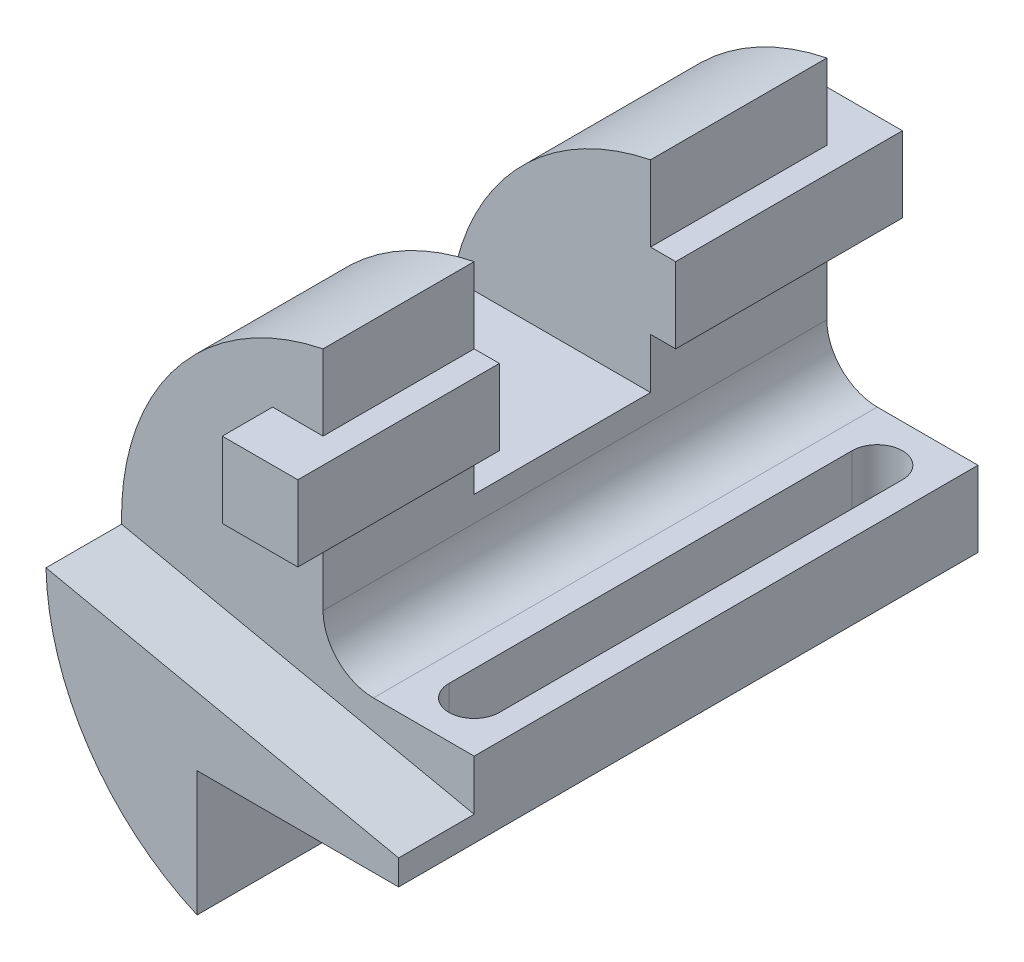
ISO-10303-21;
HEADER;
FILE_DESCRIPTION(('STEP AP214'),'2;1');
FILE_NAME('part.step','',(''),(''),'','','');
FILE_SCHEMA(('AUTOMOTIVE_DESIGN { 1 0 10303 214 1 1 1 1 }'));
ENDSEC;
DATA;
#1=APPLICATION_CONTEXT('core data for automotive mechanical design processes');
#2=APPLICATION_PROTOCOL_DEFINITION('international standard','automotive_design',2000,#1);
#3=PRODUCT_CONTEXT('',#1,'mechanical');
#4=PRODUCT('Part','Part','',(#3));
#5=PRODUCT_RELATED_PRODUCT_CATEGORY('part','',(#4));
#6=PRODUCT_DEFINITION_FORMATION('','',#4);
#7=PRODUCT_DEFINITION_CONTEXT('part definition',#1,'design');
#8=PRODUCT_DEFINITION('design','',#6,#7);
#9=PRODUCT_DEFINITION_SHAPE('','',#8);
#10=(LENGTH_UNIT() NAMED_UNIT(*) SI_UNIT(.MILLI.,.METRE.));
#11=(NAMED_UNIT(*) PLANE_ANGLE_UNIT() SI_UNIT($,.RADIAN.));
#12=(NAMED_UNIT(*) SI_UNIT($,.STERADIAN.) SOLID_ANGLE_UNIT());
#13=UNCERTAINTY_MEASURE_WITH_UNIT(LENGTH_MEASURE(1.E-05),#10,'distance_accuracy_value','');
#14=(GEOMETRIC_REPRESENTATION_CONTEXT(3) GLOBAL_UNCERTAINTY_ASSIGNED_CONTEXT((#13)) GLOBAL_UNIT_ASSIGNED_CONTEXT((#10,
#11,#12)) REPRESENTATION_CONTEXT('',''));
#15=CARTESIAN_POINT('',(0.,0.,0.));
#16=DIRECTION('',(0.,0.,1.));
#17=DIRECTION('',(1.,0.,0.));
#18=AXIS2_PLACEMENT_3D('',#15,#16,#17);
#19=CARTESIAN_POINT('',(-9.99999999999996,0.,-115.));
#20=DIRECTION('',(-1.,0.,0.));
#21=DIRECTION('',(0.,0.,1.));
#22=AXIS2_PLACEMENT_3D('',#19,#20,#21);
#23=PLANE('',#22);
#24=DIRECTION('',(0.,0.,1.));
#25=VECTOR('',#24,1.);
#26=CARTESIAN_POINT('',(-9.99999999999996,79.815551805222,-115.));
#27=LINE('',#26,#25);
#28=CARTESIAN_POINT('',(-9.99999999999996,79.815551805222,-45.));
#29=VERTEX_POINT('',#28);
#30=CARTESIAN_POINT('',(-9.99999999999996,79.815551805222,-15.));
#31=VERTEX_POINT('',#30);
#32=EDGE_CURVE('E345',#29,#31,#27,.T.);
#33=ORIENTED_EDGE('',*,*,#32,.F.);
#34=DIRECTION('',(0.,1.,0.));
#35=VECTOR('',#34,1.);
#36=CARTESIAN_POINT('',(-9.99999999999996,0.,-45.));
#37=LINE('',#36,#35);
#38=CARTESIAN_POINT('',(-10.0000000000001,94.815551805222,-45.));
#39=VERTEX_POINT('',#38);
#40=EDGE_CURVE('E292',#29,#39,#37,.T.);
#41=ORIENTED_EDGE('',*,*,#40,.T.);
#42=DIRECTION('',(0.,0.,1.));
#43=VECTOR('',#42,1.);
#44=CARTESIAN_POINT('',(-9.99999999999996,94.815551805222,-115.));
#45=LINE('',#44,#43);
#46=CARTESIAN_POINT('',(-9.99999999999996,94.815551805222,-15.));
#47=VERTEX_POINT('',#46);
#48=EDGE_CURVE('E394',#39,#47,#45,.T.);
#49=ORIENTED_EDGE('',*,*,#48,.T.);
#50=DIRECTION('',(0.,-1.,0.));
#51=VECTOR('',#50,1.);
#52=CARTESIAN_POINT('',(-9.99999999999996,0.,-15.));
#53=LINE('',#52,#51);
#54=EDGE_CURVE('E352',#47,#31,#53,.T.);
#55=ORIENTED_EDGE('',*,*,#54,.T.);
#56=EDGE_LOOP('',(#33,#41,#49,#55));
#57=FACE_BOUND('',#56,.T.);
#58=ADVANCED_FACE('F41',(#57),#23,.F.);
#59=CARTESIAN_POINT('',(-4.99999999999997,79.815551805222,26.2132034355964));
#60=DIRECTION('',(0.,-1.,0.));
#61=DIRECTION('',(1.,0.,0.));
#62=AXIS2_PLACEMENT_3D('',#59,#60,#61);
#63=PLANE('',#62);
#64=DIRECTION('',(0.,0.,-1.));
#65=VECTOR('',#64,1.);
#66=CARTESIAN_POINT('',(-4.99999999999997,79.815551805222,26.2132034355964));
#67=LINE('',#66,#65);
#68=CARTESIAN_POINT('',(-4.99999999999997,79.815551805222,-5.));
#69=VERTEX_POINT('',#68);
#70=CARTESIAN_POINT('',(-4.99999999999997,79.815551805222,-45.));
#71=VERTEX_POINT('',#70);
#72=EDGE_CURVE('E325',#69,#71,#67,.T.);
#73=ORIENTED_EDGE('',*,*,#72,.T.);
#74=DIRECTION('',(-1.,0.,0.));
#75=VECTOR('',#74,1.);
#76=CARTESIAN_POINT('',(-4.99999999999997,79.815551805222,-45.));
#77=LINE('',#76,#75);
#78=EDGE_CURVE('E289',#71,#29,#77,.T.);
#79=ORIENTED_EDGE('',*,*,#78,.T.);
#80=ORIENTED_EDGE('',*,*,#32,.T.);
#81=DIRECTION('',(1.,0.,0.));
#82=VECTOR('',#81,1.);
#83=CARTESIAN_POINT('',(0.,79.815551805222,-15.));
#84=LINE('',#83,#82);
#85=CARTESIAN_POINT('',(-20.,79.815551805222,-15.));
#86=VERTEX_POINT('',#85);
#87=EDGE_CURVE('E430',#86,#31,#84,.T.);
#88=ORIENTED_EDGE('',*,*,#87,.F.);
#89=DIRECTION('',(0.,0.,-1.));
#90=VECTOR('',#89,1.);
#91=CARTESIAN_POINT('',(-20.,79.815551805222,26.2132034355964));
#92=LINE('',#91,#90);
#93=CARTESIAN_POINT('',(-20.,79.815551805222,-5.));
#94=VERTEX_POINT('',#93);
#95=EDGE_CURVE('E330',#94,#86,#92,.T.);
#96=ORIENTED_EDGE('',*,*,#95,.F.);
#97=DIRECTION('',(-1.,0.,0.));
#98=VECTOR('',#97,1.);
#99=CARTESIAN_POINT('',(-4.99999999999997,79.815551805222,-5.));
#100=LINE('',#99,#98);
#101=EDGE_CURVE('E315',#69,#94,#100,.T.);
#102=ORIENTED_EDGE('',*,*,#101,.F.);
#103=EDGE_LOOP('',(#73,#79,#80,#88,#96,#102));
#104=FACE_BOUND('',#103,.T.);
#105=ADVANCED_FACE('F516',(#104),#63,.F.);
#106=CARTESIAN_POINT('',(-4.99999999999996,64.815551805222,26.2132034355964));
#107=DIRECTION('',(0.,1.,0.));
#108=DIRECTION('',(0.,0.,1.));
#109=AXIS2_PLACEMENT_3D('',#106,#107,#108);
#110=PLANE('',#109);
#111=DIRECTION('',(0.,0.,-1.));
#112=VECTOR('',#111,1.);
#113=CARTESIAN_POINT('',(-9.99999999999996,64.815551805222,-115.));
#114=LINE('',#113,#112);
#115=CARTESIAN_POINT('',(-9.99999999999996,64.815551805222,-15.));
#116=VERTEX_POINT('',#115);
#117=CARTESIAN_POINT('',(-9.99999999999996,64.815551805222,-45.));
#118=VERTEX_POINT('',#117);
#119=EDGE_CURVE('E338',#116,#118,#114,.T.);
#120=ORIENTED_EDGE('',*,*,#119,.T.);
#121=DIRECTION('',(1.,0.,0.));
#122=VECTOR('',#121,1.);
#123=CARTESIAN_POINT('',(-4.99999999999996,64.815551805222,-45.));
#124=LINE('',#123,#122);
#125=CARTESIAN_POINT('',(-4.99999999999997,64.815551805222,-45.));
#126=VERTEX_POINT('',#125);
#127=EDGE_CURVE('E283',#118,#126,#124,.T.);
#128=ORIENTED_EDGE('',*,*,#127,.T.);
#129=DIRECTION('',(0.,0.,-1.));
#130=VECTOR('',#129,1.);
#131=CARTESIAN_POINT('',(-4.99999999999996,64.815551805222,26.2132034355964));
#132=LINE('',#131,#130);
#133=CARTESIAN_POINT('',(-4.99999999999996,64.815551805222,-5.));
#134=VERTEX_POINT('',#133);
#135=EDGE_CURVE('E335',#134,#126,#132,.T.);
#136=ORIENTED_EDGE('',*,*,#135,.F.);
#137=DIRECTION('',(1.,0.,0.));
#138=VECTOR('',#137,1.);
#139=CARTESIAN_POINT('',(-4.99999999999996,64.815551805222,-5.));
#140=LINE('',#139,#138);
#141=CARTESIAN_POINT('',(-20.,64.815551805222,-5.));
#142=VERTEX_POINT('',#141);
#143=EDGE_CURVE('E321',#142,#134,#140,.T.);
#144=ORIENTED_EDGE('',*,*,#143,.F.);
#145=DIRECTION('',(0.,0.,-1.));
#146=VECTOR('',#145,1.);
#147=CARTESIAN_POINT('',(-20.,64.815551805222,26.2132034355964));
#148=LINE('',#147,#146);
#149=CARTESIAN_POINT('',(-20.,64.815551805222,-15.));
#150=VERTEX_POINT('',#149);
#151=EDGE_CURVE('E324',#142,#150,#148,.T.);
#152=ORIENTED_EDGE('',*,*,#151,.T.);
#153=DIRECTION('',(-1.,0.,0.));
#154=VECTOR('',#153,1.);
#155=CARTESIAN_POINT('',(0.,64.815551805222,-15.));
#156=LINE('',#155,#154);
#157=EDGE_CURVE('E406',#116,#150,#156,.T.);
#158=ORIENTED_EDGE('',*,*,#157,.F.);
#159=EDGE_LOOP('',(#120,#128,#136,#144,#152,#158));
#160=FACE_BOUND('',#159,.T.);
#161=ADVANCED_FACE('F529',(#160),#110,.F.);
#162=CARTESIAN_POINT('',(-4.99999999999997,79.815551805222,26.2132034355964));
#163=DIRECTION('',(-1.,0.,0.));
#164=DIRECTION('',(0.,-1.,0.));
#165=AXIS2_PLACEMENT_3D('',#162,#163,#164);
#166=PLANE('',#165);
#167=ORIENTED_EDGE('',*,*,#135,.T.);
#168=DIRECTION('',(0.,1.,0.));
#169=VECTOR('',#168,1.);
#170=CARTESIAN_POINT('',(-4.99999999999997,79.815551805222,-45.));
#171=LINE('',#170,#169);
#172=EDGE_CURVE('E12',#126,#71,#171,.T.);
#173=ORIENTED_EDGE('',*,*,#172,.T.);
#174=ORIENTED_EDGE('',*,*,#72,.F.);
#175=DIRECTION('',(0.,1.,0.));
#176=VECTOR('',#175,1.);
#177=CARTESIAN_POINT('',(-4.99999999999997,79.815551805222,-5.));
#178=LINE('',#177,#176);
#179=EDGE_CURVE('E318',#134,#69,#178,.T.);
#180=ORIENTED_EDGE('',*,*,#179,.F.);
#181=EDGE_LOOP('',(#167,#173,#174,#180));
#182=FACE_BOUND('',#181,.T.);
#183=ADVANCED_FACE('F525',(#182),#166,.F.);
#184=CARTESIAN_POINT('',(-9.99999999999996,94.815551805222,-115.));
#185=VERTEX_POINT('',#184);
#186=CARTESIAN_POINT('',(-10.0000000000001,94.8155518052219,-80.));
#187=VERTEX_POINT('',#186);
#188=EDGE_CURVE('E422',#185,#187,#45,.T.);
#189=ORIENTED_EDGE('',*,*,#188,.T.);
#190=DIRECTION('',(0.,-1.,0.));
#191=VECTOR('',#190,1.);
#192=CARTESIAN_POINT('',(-9.99999999999996,0.,-80.));
#193=LINE('',#192,#191);
#194=CARTESIAN_POINT('',(-9.99999999999996,79.815551805222,-80.));
#195=VERTEX_POINT('',#194);
#196=EDGE_CURVE('E280',#187,#195,#193,.T.);
#197=ORIENTED_EDGE('',*,*,#196,.T.);
#198=CARTESIAN_POINT('',(-9.99999999999996,79.815551805222,-115.));
#199=VERTEX_POINT('',#198);
#200=EDGE_CURVE('E346',#199,#195,#27,.T.);
#201=ORIENTED_EDGE('',*,*,#200,.F.);
#202=DIRECTION('',(0.,-1.,0.));
#203=VECTOR('',#202,1.);
#204=CARTESIAN_POINT('',(-9.99999999999996,0.,-115.));
#205=LINE('',#204,#203);
#206=EDGE_CURVE('E378',#185,#199,#205,.T.);
#207=ORIENTED_EDGE('',*,*,#206,.F.);
#208=EDGE_LOOP('',(#189,#197,#201,#207));
#209=FACE_BOUND('',#208,.T.);
#210=ADVANCED_FACE('F43',(#209),#23,.F.);
#211=DIRECTION('',(0.,0.,1.));
#212=VECTOR('',#211,1.);
#213=CARTESIAN_POINT('',(-9.99999999999996,54.815551805222,-115.));
#214=LINE('',#213,#212);
#215=CARTESIAN_POINT('',(-9.99999999999997,54.815551805222,-80.));
#216=VERTEX_POINT('',#215);
#217=CARTESIAN_POINT('',(-9.99999999999997,54.815551805222,-45.));
#218=VERTEX_POINT('',#217);
#219=EDGE_CURVE('E295',#216,#218,#214,.T.);
#220=ORIENTED_EDGE('',*,*,#219,.T.);
#221=DIRECTION('',(0.,1.,0.));
#222=VECTOR('',#221,1.);
#223=CARTESIAN_POINT('',(-9.99999999999996,0.,-45.));
#224=LINE('',#223,#222);
#225=EDGE_CURVE('E286',#218,#118,#224,.T.);
#226=ORIENTED_EDGE('',*,*,#225,.T.);
#227=ORIENTED_EDGE('',*,*,#119,.F.);
#228=CARTESIAN_POINT('',(-9.99999999999996,49.815551805222,-15.));
#229=VERTEX_POINT('',#228);
#230=EDGE_CURVE('E356',#116,#229,#53,.T.);
#231=ORIENTED_EDGE('',*,*,#230,.T.);
#232=DIRECTION('',(0.,0.,1.));
#233=VECTOR('',#232,1.);
#234=CARTESIAN_POINT('',(-9.99999999999996,49.815551805222,-115.));
#235=LINE('',#234,#233);
#236=CARTESIAN_POINT('',(-9.99999999999996,49.815551805222,-115.));
#237=VERTEX_POINT('',#236);
#238=EDGE_CURVE('E403',#237,#229,#235,.T.);
#239=ORIENTED_EDGE('',*,*,#238,.F.);
#240=CARTESIAN_POINT('',(-9.99999999999996,64.815551805222,-115.));
#241=VERTEX_POINT('',#240);
#242=EDGE_CURVE('E382',#241,#237,#205,.T.);
#243=ORIENTED_EDGE('',*,*,#242,.F.);
#244=CARTESIAN_POINT('',(-9.99999999999996,64.815551805222,-80.));
#245=VERTEX_POINT('',#244);
#246=EDGE_CURVE('E314',#245,#241,#114,.T.);
#247=ORIENTED_EDGE('',*,*,#246,.F.);
#248=DIRECTION('',(0.,-1.,0.));
#249=VECTOR('',#248,1.);
#250=CARTESIAN_POINT('',(-9.99999999999996,0.,-80.));
#251=LINE('',#250,#249);
#252=EDGE_CURVE('E274',#245,#216,#251,.T.);
#253=ORIENTED_EDGE('',*,*,#252,.T.);
#254=EDGE_LOOP('',(#220,#226,#227,#231,#239,#243,#247,#253));
#255=FACE_BOUND('',#254,.T.);
#256=ADVANCED_FACE('F473',(#255),#23,.F.);
#257=CARTESIAN_POINT('',(0.,0.,-115.));
#258=DIRECTION('',(0.,0.,1.));
#259=DIRECTION('',(1.,0.,0.));
#260=AXIS2_PLACEMENT_3D('',#257,#258,#259);
#261=PLANE('',#260);
#262=DIRECTION('',(1.,0.,0.));
#263=VECTOR('',#262,1.);
#264=CARTESIAN_POINT('',(0.,79.815551805222,-115.));
#265=LINE('',#264,#263);
#266=CARTESIAN_POINT('',(-20.,79.815551805222,-115.));
#267=VERTEX_POINT('',#266);
#268=EDGE_CURVE('E349',#267,#199,#265,.T.);
#269=ORIENTED_EDGE('',*,*,#268,.F.);
#270=DIRECTION('',(0.,1.,0.));
#271=VECTOR('',#270,1.);
#272=CARTESIAN_POINT('',(-19.9999999999999,0.,-115.));
#273=LINE('',#272,#271);
#274=CARTESIAN_POINT('',(-20.,64.815551805222,-115.));
#275=VERTEX_POINT('',#274);
#276=EDGE_CURVE('E343',#275,#267,#273,.T.);
#277=ORIENTED_EDGE('',*,*,#276,.F.);
#278=DIRECTION('',(-1.,0.,0.));
#279=VECTOR('',#278,1.);
#280=CARTESIAN_POINT('',(0.,64.815551805222,-115.));
#281=LINE('',#280,#279);
#282=EDGE_CURVE('E341',#241,#275,#281,.T.);
#283=ORIENTED_EDGE('',*,*,#282,.F.);
#284=ORIENTED_EDGE('',*,*,#242,.T.);
#285=CARTESIAN_POINT('',(0.,49.815551805222,-115.));
#286=DIRECTION('',(0.,0.,1.));
#287=DIRECTION('',(1.,0.,0.));
#288=AXIS2_PLACEMENT_3D('',#285,#286,#287);
#289=CIRCLE('',#288,10.);
#290=CARTESIAN_POINT('',(0.,39.815551805222,-115.));
#291=VERTEX_POINT('',#290);
#292=EDGE_CURVE('E392',#237,#291,#289,.T.);
#293=ORIENTED_EDGE('',*,*,#292,.T.);
#294=DIRECTION('',(1.,0.,0.));
#295=VECTOR('',#294,1.);
#296=CARTESIAN_POINT('',(0.,39.815551805222,-115.));
#297=LINE('',#296,#295);
#298=CARTESIAN_POINT('',(20.,39.815551805222,-115.));
#299=VERTEX_POINT('',#298);
#300=EDGE_CURVE('E390',#291,#299,#297,.T.);
#301=ORIENTED_EDGE('',*,*,#300,.T.);
#302=DIRECTION('',(0.,-1.,0.));
#303=VECTOR('',#302,1.);
#304=CARTESIAN_POINT('',(20.,0.,-115.));
#305=LINE('',#304,#303);
#306=CARTESIAN_POINT('',(20.,24.815551805222,-115.));
#307=VERTEX_POINT('',#306);
#308=EDGE_CURVE('E388',#299,#307,#305,.T.);
#309=ORIENTED_EDGE('',*,*,#308,.T.);
#310=DIRECTION('',(-1.,0.,0.));
#311=VECTOR('',#310,1.);
#312=CARTESIAN_POINT('',(0.,24.815551805222,-115.));
#313=LINE('',#312,#311);
#314=CARTESIAN_POINT('',(-20.,24.815551805222,-115.));
#315=VERTEX_POINT('',#314);
#316=EDGE_CURVE('E386',#307,#315,#313,.T.);
#317=ORIENTED_EDGE('',*,*,#316,.T.);
#318=DIRECTION('',(0.,-1.,0.));
#319=VECTOR('',#318,1.);
#320=CARTESIAN_POINT('',(-20.,0.,-115.));
#321=LINE('',#320,#319);
#322=CARTESIAN_POINT('',(-20.,0.,-115.));
#323=VERTEX_POINT('',#322);
#324=EDGE_CURVE('E384',#315,#323,#321,.T.);
#325=ORIENTED_EDGE('',*,*,#324,.T.);
#326=CARTESIAN_POINT('',(0.,45.8257569495584,-115.));
#327=DIRECTION('',(0.,0.,1.));
#328=DIRECTION('',(1.,0.,0.));
#329=AXIS2_PLACEMENT_3D('',#326,#327,#328);
#330=CIRCLE('',#329,50.);
#331=EDGE_CURVE('E381',#323,#185,#330,.F.);
#332=ORIENTED_EDGE('',*,*,#331,.T.);
#333=ORIENTED_EDGE('',*,*,#206,.T.);
#334=EDGE_LOOP('',(#269,#277,#283,#284,#293,#301,#309,#317,#325,#332,#333));
#335=FACE_BOUND('',#334,.T.);
#336=ADVANCED_FACE('F457',(#335),#261,.F.);
#337=CARTESIAN_POINT('',(0.,0.,-15.));
#338=DIRECTION('',(0.,0.,1.));
#339=DIRECTION('',(1.,0.,0.));
#340=AXIS2_PLACEMENT_3D('',#337,#338,#339);
#341=PLANE('',#340);
#342=DIRECTION('',(0.,1.,0.));
#343=VECTOR('',#342,1.);
#344=CARTESIAN_POINT('',(-19.9999999999999,0.,-15.));
#345=LINE('',#344,#343);
#346=EDGE_CURVE('E427',#150,#86,#345,.T.);
#347=ORIENTED_EDGE('',*,*,#346,.T.);
#348=ORIENTED_EDGE('',*,*,#87,.T.);
#349=ORIENTED_EDGE('',*,*,#54,.F.);
#350=CARTESIAN_POINT('',(0.,45.8257569495584,-15.));
#351=DIRECTION('',(0.,0.,1.));
#352=DIRECTION('',(1.,0.,0.));
#353=AXIS2_PLACEMENT_3D('',#350,#351,#352);
#354=CIRCLE('',#353,50.);
#355=CARTESIAN_POINT('',(-49.987139251767,44.6917774856984,-15.));
#356=VERTEX_POINT('',#355);
#357=EDGE_CURVE('E355',#356,#47,#354,.F.);
#358=ORIENTED_EDGE('',*,*,#357,.F.);
#359=DIRECTION('',(0.978147600733806,-0.207911690817756,0.));
#360=VECTOR('',#359,1.);
#361=CARTESIAN_POINT('',(6.92808414992817,32.5940732927531,-15.));
#362=LINE('',#361,#360);
#363=CARTESIAN_POINT('',(20.,29.815551805222,-15.));
#364=VERTEX_POINT('',#363);
#365=EDGE_CURVE('E359',#356,#364,#362,.T.);
#366=ORIENTED_EDGE('',*,*,#365,.T.);
#367=DIRECTION('',(0.,-1.,0.));
#368=VECTOR('',#367,1.);
#369=CARTESIAN_POINT('',(20.,0.,-15.));
#370=LINE('',#369,#368);
#371=CARTESIAN_POINT('',(20.,39.815551805222,-15.));
#372=VERTEX_POINT('',#371);
#373=EDGE_CURVE('E362',#372,#364,#370,.T.);
#374=ORIENTED_EDGE('',*,*,#373,.F.);
#375=DIRECTION('',(1.,0.,0.));
#376=VECTOR('',#375,1.);
#377=CARTESIAN_POINT('',(0.,39.815551805222,-15.));
#378=LINE('',#377,#376);
#379=CARTESIAN_POINT('',(0.,39.815551805222,-15.));
#380=VERTEX_POINT('',#379);
#381=EDGE_CURVE('E365',#380,#372,#378,.T.);
#382=ORIENTED_EDGE('',*,*,#381,.F.);
#383=CARTESIAN_POINT('',(0.,49.815551805222,-15.));
#384=DIRECTION('',(0.,0.,1.));
#385=DIRECTION('',(1.,0.,0.));
#386=AXIS2_PLACEMENT_3D('',#383,#384,#385);
#387=CIRCLE('',#386,10.);
#388=EDGE_CURVE('E368',#229,#380,#387,.T.);
#389=ORIENTED_EDGE('',*,*,#388,.F.);
#390=ORIENTED_EDGE('',*,*,#230,.F.);
#391=ORIENTED_EDGE('',*,*,#157,.T.);
#392=EDGE_LOOP('',(#347,#348,#349,#358,#366,#374,#382,#389,#390,#391));
#393=FACE_BOUND('',#392,.T.);
#394=ADVANCED_FACE('F485',(#393),#341,.T.);
#395=CARTESIAN_POINT('',(0.,49.815551805222,-115.));
#396=DIRECTION('',(0.,0.,1.));
#397=DIRECTION('',(1.,0.,0.));
#398=AXIS2_PLACEMENT_3D('',#395,#396,#397);
#399=CYLINDRICAL_SURFACE('',#398,10.);
#400=ORIENTED_EDGE('',*,*,#388,.T.);
#401=DIRECTION('',(0.,0.,1.));
#402=VECTOR('',#401,1.);
#403=CARTESIAN_POINT('',(0.,39.815551805222,-115.));
#404=LINE('',#403,#402);
#405=EDGE_CURVE('E407',#291,#380,#404,.T.);
#406=ORIENTED_EDGE('',*,*,#405,.F.);
#407=ORIENTED_EDGE('',*,*,#292,.F.);
#408=ORIENTED_EDGE('',*,*,#238,.T.);
#409=EDGE_LOOP('',(#400,#406,#407,#408));
#410=FACE_BOUND('',#409,.T.);
#411=ADVANCED_FACE('F479',(#410),#399,.F.);
#412=CARTESIAN_POINT('',(0.,39.815551805222,-115.));
#413=DIRECTION('',(0.,-1.,0.));
#414=DIRECTION('',(0.,0.,-1.));
#415=AXIS2_PLACEMENT_3D('',#412,#413,#414);
#416=PLANE('',#415);
#417=DIRECTION('',(0.,0.,-1.));
#418=VECTOR('',#417,1.);
#419=CARTESIAN_POINT('',(15.,39.815551805222,-25.));
#420=LINE('',#419,#418);
#421=CARTESIAN_POINT('',(15.,39.815551805222,-25.));
#422=VERTEX_POINT('',#421);
#423=CARTESIAN_POINT('',(15.,39.815551805222,-105.));
#424=VERTEX_POINT('',#423);
#425=EDGE_CURVE('E238',#422,#424,#420,.T.);
#426=ORIENTED_EDGE('',*,*,#425,.F.);
#427=CARTESIAN_POINT('',(9.99999999999997,39.815551805222,-25.));
#428=DIRECTION('',(0.,1.,0.));
#429=DIRECTION('',(0.,0.,1.));
#430=AXIS2_PLACEMENT_3D('',#427,#428,#429);
#431=CIRCLE('',#430,5.);
#432=CARTESIAN_POINT('',(4.99999999999996,39.815551805222,-25.));
#433=VERTEX_POINT('',#432);
#434=EDGE_CURVE('E56',#433,#422,#431,.T.);
#435=ORIENTED_EDGE('',*,*,#434,.F.);
#436=DIRECTION('',(0.,0.,1.));
#437=VECTOR('',#436,1.);
#438=CARTESIAN_POINT('',(4.99999999999996,39.815551805222,-25.));
#439=LINE('',#438,#437);
#440=CARTESIAN_POINT('',(4.99999999999996,39.815551805222,-105.));
#441=VERTEX_POINT('',#440);
#442=EDGE_CURVE('E245',#441,#433,#439,.T.);
#443=ORIENTED_EDGE('',*,*,#442,.F.);
#444=CARTESIAN_POINT('',(9.99999999999996,39.815551805222,-105.));
#445=DIRECTION('',(0.,1.,0.));
#446=DIRECTION('',(0.,0.,1.));
#447=AXIS2_PLACEMENT_3D('',#444,#445,#446);
#448=CIRCLE('',#447,5.);
#449=EDGE_CURVE('E229',#424,#441,#448,.T.);
#450=ORIENTED_EDGE('',*,*,#449,.F.);
#451=EDGE_LOOP('',(#426,#435,#443,#450));
#452=FACE_BOUND('',#451,.T.);
#453=ORIENTED_EDGE('',*,*,#381,.T.);
#454=DIRECTION('',(0.,0.,1.));
#455=VECTOR('',#454,1.);
#456=CARTESIAN_POINT('',(20.,39.815551805222,-115.));
#457=LINE('',#456,#455);
#458=EDGE_CURVE('E410',#299,#372,#457,.T.);
#459=ORIENTED_EDGE('',*,*,#458,.F.);
#460=ORIENTED_EDGE('',*,*,#300,.F.);
#461=ORIENTED_EDGE('',*,*,#405,.T.);
#462=EDGE_LOOP('',(#453,#459,#460,#461));
#463=FACE_BOUND('',#462,.T.);
#464=ADVANCED_FACE('F242',(#452,#463),#416,.F.);
#465=CARTESIAN_POINT('',(20.,0.,-115.));
#466=DIRECTION('',(-1.,0.,0.));
#467=DIRECTION('',(0.,-1.,0.));
#468=AXIS2_PLACEMENT_3D('',#465,#466,#467);
#469=PLANE('',#468);
#470=ORIENTED_EDGE('',*,*,#373,.T.);
#471=DIRECTION('',(0.,0.,1.));
#472=VECTOR('',#471,1.);
#473=CARTESIAN_POINT('',(20.,29.815551805222,-15.));
#474=LINE('',#473,#472);
#475=CARTESIAN_POINT('',(20.,29.815551805222,0.));
#476=VERTEX_POINT('',#475);
#477=EDGE_CURVE('E373',#364,#476,#474,.T.);
#478=ORIENTED_EDGE('',*,*,#477,.T.);
#479=DIRECTION('',(0.,-1.,0.));
#480=VECTOR('',#479,1.);
#481=CARTESIAN_POINT('',(20.,0.,0.));
#482=LINE('',#481,#480);
#483=CARTESIAN_POINT('',(20.,24.815551805222,0.));
#484=VERTEX_POINT('',#483);
#485=EDGE_CURVE('E401',#476,#484,#482,.T.);
#486=ORIENTED_EDGE('',*,*,#485,.T.);
#487=DIRECTION('',(0.,0.,1.));
#488=VECTOR('',#487,1.);
#489=CARTESIAN_POINT('',(20.,24.815551805222,-115.));
#490=LINE('',#489,#488);
#491=EDGE_CURVE('E413',#307,#484,#490,.T.);
#492=ORIENTED_EDGE('',*,*,#491,.F.);
#493=ORIENTED_EDGE('',*,*,#308,.F.);
#494=ORIENTED_EDGE('',*,*,#458,.T.);
#495=EDGE_LOOP('',(#470,#478,#486,#492,#493,#494));
#496=FACE_BOUND('',#495,.T.);
#497=ADVANCED_FACE('F492',(#496),#469,.F.);
#498=CARTESIAN_POINT('',(0.,24.815551805222,-115.));
#499=DIRECTION('',(0.,1.,0.));
#500=DIRECTION('',(-1.,0.,0.));
#501=AXIS2_PLACEMENT_3D('',#498,#499,#500);
#502=PLANE('',#501);
#503=DIRECTION('',(0.,0.,-1.));
#504=VECTOR('',#503,1.);
#505=CARTESIAN_POINT('',(4.99999999999996,24.815551805222,-25.));
#506=LINE('',#505,#504);
#507=CARTESIAN_POINT('',(4.99999999999996,24.815551805222,-25.));
#508=VERTEX_POINT('',#507);
#509=CARTESIAN_POINT('',(4.99999999999996,24.815551805222,-105.));
#510=VERTEX_POINT('',#509);
#511=EDGE_CURVE('E783',#508,#510,#506,.T.);
#512=ORIENTED_EDGE('',*,*,#511,.F.);
#513=CARTESIAN_POINT('',(9.99999999999997,24.815551805222,-25.));
#514=DIRECTION('',(0.,1.,0.));
#515=DIRECTION('',(-1.,0.,0.));
#516=AXIS2_PLACEMENT_3D('',#513,#514,#515);
#517=CIRCLE('',#516,5.);
#518=CARTESIAN_POINT('',(15.,24.815551805222,-25.));
#519=VERTEX_POINT('',#518);
#520=EDGE_CURVE('E257',#519,#508,#517,.F.);
#521=ORIENTED_EDGE('',*,*,#520,.F.);
#522=DIRECTION('',(0.,0.,1.));
#523=VECTOR('',#522,1.);
#524=CARTESIAN_POINT('',(15.,24.815551805222,-25.));
#525=LINE('',#524,#523);
#526=CARTESIAN_POINT('',(15.,24.815551805222,-105.));
#527=VERTEX_POINT('',#526);
#528=EDGE_CURVE('E254',#527,#519,#525,.T.);
#529=ORIENTED_EDGE('',*,*,#528,.F.);
#530=CARTESIAN_POINT('',(9.99999999999996,24.815551805222,-105.));
#531=DIRECTION('',(0.,1.,0.));
#532=DIRECTION('',(-1.,0.,0.));
#533=AXIS2_PLACEMENT_3D('',#530,#531,#532);
#534=CIRCLE('',#533,5.);
#535=EDGE_CURVE('E232',#510,#527,#534,.F.);
#536=ORIENTED_EDGE('',*,*,#535,.F.);
#537=EDGE_LOOP('',(#512,#521,#529,#536));
#538=FACE_BOUND('',#537,.T.);
#539=DIRECTION('',(-1.,0.,0.));
#540=VECTOR('',#539,1.);
#541=CARTESIAN_POINT('',(0.,24.815551805222,0.));
#542=LINE('',#541,#540);
#543=CARTESIAN_POINT('',(-20.,24.815551805222,0.));
#544=VERTEX_POINT('',#543);
#545=EDGE_CURVE('E399',#484,#544,#542,.T.);
#546=ORIENTED_EDGE('',*,*,#545,.T.);
#547=DIRECTION('',(0.,0.,1.));
#548=VECTOR('',#547,1.);
#549=CARTESIAN_POINT('',(-20.,24.815551805222,-115.));
#550=LINE('',#549,#548);
#551=EDGE_CURVE('E416',#315,#544,#550,.T.);
#552=ORIENTED_EDGE('',*,*,#551,.F.);
#553=ORIENTED_EDGE('',*,*,#316,.F.);
#554=ORIENTED_EDGE('',*,*,#491,.T.);
#555=EDGE_LOOP('',(#546,#552,#553,#554));
#556=FACE_BOUND('',#555,.T.);
#557=ADVANCED_FACE('F496',(#538,#556),#502,.F.);
#558=CARTESIAN_POINT('',(-20.,0.,-115.));
#559=DIRECTION('',(-1.,0.,0.));
#560=DIRECTION('',(0.,-1.,0.));
#561=AXIS2_PLACEMENT_3D('',#558,#559,#560);
#562=PLANE('',#561);
#563=DIRECTION('',(0.,-1.,0.));
#564=VECTOR('',#563,1.);
#565=CARTESIAN_POINT('',(-20.,0.,0.));
#566=LINE('',#565,#564);
#567=CARTESIAN_POINT('',(-20.,0.,0.));
#568=VERTEX_POINT('',#567);
#569=EDGE_CURVE('E397',#544,#568,#566,.T.);
#570=ORIENTED_EDGE('',*,*,#569,.T.);
#571=DIRECTION('',(0.,0.,1.));
#572=VECTOR('',#571,1.);
#573=CARTESIAN_POINT('',(-20.,0.,-115.));
#574=LINE('',#573,#572);
#575=EDGE_CURVE('E419',#323,#568,#574,.T.);
#576=ORIENTED_EDGE('',*,*,#575,.F.);
#577=ORIENTED_EDGE('',*,*,#324,.F.);
#578=ORIENTED_EDGE('',*,*,#551,.T.);
#579=EDGE_LOOP('',(#570,#576,#577,#578));
#580=FACE_BOUND('',#579,.T.);
#581=ADVANCED_FACE('F501',(#580),#562,.F.);
#582=CARTESIAN_POINT('',(0.,45.8257569495584,-115.));
#583=DIRECTION('',(0.,0.,1.));
#584=DIRECTION('',(1.,0.,0.));
#585=AXIS2_PLACEMENT_3D('',#582,#583,#584);
#586=CYLINDRICAL_SURFACE('',#585,50.);
#587=ORIENTED_EDGE('',*,*,#48,.F.);
#588=CARTESIAN_POINT('',(0.,45.8257569495584,-45.));
#589=DIRECTION('',(0.,0.,1.));
#590=DIRECTION('',(0.,-1.,0.));
#591=AXIS2_PLACEMENT_3D('',#588,#589,#590);
#592=CIRCLE('',#591,50.);
#593=CARTESIAN_POINT('',(-49.185196842679,54.815551805222,-45.));
#594=VERTEX_POINT('',#593);
#595=EDGE_CURVE('E262',#594,#39,#592,.F.);
#596=ORIENTED_EDGE('',*,*,#595,.F.);
#597=DIRECTION('',(0.,0.,1.));
#598=VECTOR('',#597,1.);
#599=CARTESIAN_POINT('',(-49.185196842679,54.815551805222,-115.));
#600=LINE('',#599,#598);
#601=CARTESIAN_POINT('',(-49.185196842679,54.815551805222,-80.));
#602=VERTEX_POINT('',#601);
#603=EDGE_CURVE('E264',#602,#594,#600,.T.);
#604=ORIENTED_EDGE('',*,*,#603,.F.);
#605=CARTESIAN_POINT('',(0.,45.8257569495584,-80.));
#606=DIRECTION('',(0.,0.,-1.));
#607=DIRECTION('',(-1.,0.,0.));
#608=AXIS2_PLACEMENT_3D('',#605,#606,#607);
#609=CIRCLE('',#608,50.);
#610=EDGE_CURVE('E258',#187,#602,#609,.F.);
#611=ORIENTED_EDGE('',*,*,#610,.F.);
#612=ORIENTED_EDGE('',*,*,#188,.F.);
#613=ORIENTED_EDGE('',*,*,#331,.F.);
#614=ORIENTED_EDGE('',*,*,#575,.T.);
#615=CARTESIAN_POINT('',(0.,45.8257569495584,0.));
#616=DIRECTION('',(0.,0.,1.));
#617=DIRECTION('',(1.,0.,0.));
#618=AXIS2_PLACEMENT_3D('',#615,#616,#617);
#619=CIRCLE('',#618,50.);
#620=CARTESIAN_POINT('',(-49.987139251767,44.6917774856984,0.));
#621=VERTEX_POINT('',#620);
#622=EDGE_CURVE('E376',#568,#621,#619,.F.);
#623=ORIENTED_EDGE('',*,*,#622,.T.);
#624=DIRECTION('',(0.,0.,1.));
#625=VECTOR('',#624,1.);
#626=CARTESIAN_POINT('',(-49.987139251767,44.6917774856984,-15.));
#627=LINE('',#626,#625);
#628=EDGE_CURVE('E371',#356,#621,#627,.T.);
#629=ORIENTED_EDGE('',*,*,#628,.F.);
#630=ORIENTED_EDGE('',*,*,#357,.T.);
#631=EDGE_LOOP('',(#587,#596,#604,#611,#612,#613,#614,#623,#629,#630));
#632=FACE_BOUND('',#631,.T.);
#633=ADVANCED_FACE('F468',(#632),#586,.T.);
#634=CARTESIAN_POINT('',(0.,0.,0.));
#635=DIRECTION('',(0.,0.,1.));
#636=DIRECTION('',(1.,0.,0.));
#637=AXIS2_PLACEMENT_3D('',#634,#635,#636);
#638=PLANE('',#637);
#639=DIRECTION('',(0.978147600733806,-0.207911690817756,0.));
#640=VECTOR('',#639,1.);
#641=CARTESIAN_POINT('',(6.92808414992817,32.5940732927531,0.));
#642=LINE('',#641,#640);
#643=EDGE_CURVE('E351',#621,#476,#642,.T.);
#644=ORIENTED_EDGE('',*,*,#643,.F.);
#645=ORIENTED_EDGE('',*,*,#622,.F.);
#646=ORIENTED_EDGE('',*,*,#569,.F.);
#647=ORIENTED_EDGE('',*,*,#545,.F.);
#648=ORIENTED_EDGE('',*,*,#485,.F.);
#649=EDGE_LOOP('',(#644,#645,#646,#647,#648));
#650=FACE_BOUND('',#649,.T.);
#651=ADVANCED_FACE('F506',(#650),#638,.T.);
#652=CARTESIAN_POINT('',(6.92808414992817,32.5940732927531,-15.));
#653=DIRECTION('',(-0.207911690817756,-0.978147600733806,0.));
#654=DIRECTION('',(0.978147600733806,-0.207911690817756,0.));
#655=AXIS2_PLACEMENT_3D('',#652,#653,#654);
#656=PLANE('',#655);
#657=ORIENTED_EDGE('',*,*,#643,.T.);
#658=ORIENTED_EDGE('',*,*,#477,.F.);
#659=ORIENTED_EDGE('',*,*,#365,.F.);
#660=ORIENTED_EDGE('',*,*,#628,.T.);
#661=EDGE_LOOP('',(#657,#658,#659,#660));
#662=FACE_BOUND('',#661,.T.);
#663=ADVANCED_FACE('F508',(#662),#656,.F.);
#664=ORIENTED_EDGE('',*,*,#200,.T.);
#665=DIRECTION('',(1.,0.,0.));
#666=VECTOR('',#665,1.);
#667=CARTESIAN_POINT('',(-4.99999999999997,79.815551805222,-80.));
#668=LINE('',#667,#666);
#669=CARTESIAN_POINT('',(-4.99999999999997,79.815551805222,-80.));
#670=VERTEX_POINT('',#669);
#671=EDGE_CURVE('E277',#195,#670,#668,.T.);
#672=ORIENTED_EDGE('',*,*,#671,.T.);
#673=CARTESIAN_POINT('',(-4.99999999999997,79.815551805222,-125.));
#674=VERTEX_POINT('',#673);
#675=EDGE_CURVE('E329',#670,#674,#67,.T.);
#676=ORIENTED_EDGE('',*,*,#675,.T.);
#677=DIRECTION('',(1.,0.,0.));
#678=VECTOR('',#677,1.);
#679=CARTESIAN_POINT('',(-4.99999999999997,79.815551805222,-125.));
#680=LINE('',#679,#678);
#681=CARTESIAN_POINT('',(-20.,79.815551805222,-125.));
#682=VERTEX_POINT('',#681);
#683=EDGE_CURVE('E307',#682,#674,#680,.T.);
#684=ORIENTED_EDGE('',*,*,#683,.F.);
#685=EDGE_CURVE('E328',#267,#682,#92,.T.);
#686=ORIENTED_EDGE('',*,*,#685,.F.);
#687=ORIENTED_EDGE('',*,*,#268,.T.);
#688=EDGE_LOOP('',(#664,#672,#676,#684,#686,#687));
#689=FACE_BOUND('',#688,.T.);
#690=ADVANCED_FACE('F454',(#689),#63,.F.);
#691=CARTESIAN_POINT('',(-20.,79.815551805222,26.2132034355964));
#692=DIRECTION('',(1.,0.,0.));
#693=DIRECTION('',(0.,1.,0.));
#694=AXIS2_PLACEMENT_3D('',#691,#692,#693);
#695=PLANE('',#694);
#696=CARTESIAN_POINT('',(-20.,64.815551805222,-125.));
#697=VERTEX_POINT('',#696);
#698=EDGE_CURVE('E333',#275,#697,#148,.T.);
#699=ORIENTED_EDGE('',*,*,#698,.F.);
#700=ORIENTED_EDGE('',*,*,#276,.T.);
#701=ORIENTED_EDGE('',*,*,#685,.T.);
#702=DIRECTION('',(0.,1.,0.));
#703=VECTOR('',#702,1.);
#704=CARTESIAN_POINT('',(-20.,79.815551805222,-125.));
#705=LINE('',#704,#703);
#706=EDGE_CURVE('E298',#697,#682,#705,.T.);
#707=ORIENTED_EDGE('',*,*,#706,.F.);
#708=EDGE_LOOP('',(#699,#700,#701,#707));
#709=FACE_BOUND('',#708,.T.);
#710=ADVANCED_FACE('F449',(#709),#695,.F.);
#711=CARTESIAN_POINT('',(-4.99999999999996,64.815551805222,-80.));
#712=VERTEX_POINT('',#711);
#713=CARTESIAN_POINT('',(-4.99999999999996,64.815551805222,-125.));
#714=VERTEX_POINT('',#713);
#715=EDGE_CURVE('E310',#712,#714,#132,.T.);
#716=ORIENTED_EDGE('',*,*,#715,.F.);
#717=DIRECTION('',(-1.,0.,0.));
#718=VECTOR('',#717,1.);
#719=CARTESIAN_POINT('',(-4.99999999999996,64.815551805222,-80.));
#720=LINE('',#719,#718);
#721=EDGE_CURVE('E261',#712,#245,#720,.T.);
#722=ORIENTED_EDGE('',*,*,#721,.T.);
#723=ORIENTED_EDGE('',*,*,#246,.T.);
#724=ORIENTED_EDGE('',*,*,#282,.T.);
#725=ORIENTED_EDGE('',*,*,#698,.T.);
#726=DIRECTION('',(-1.,0.,0.));
#727=VECTOR('',#726,1.);
#728=CARTESIAN_POINT('',(-4.99999999999996,64.815551805222,-125.));
#729=LINE('',#728,#727);
#730=EDGE_CURVE('E301',#714,#697,#729,.T.);
#731=ORIENTED_EDGE('',*,*,#730,.F.);
#732=EDGE_LOOP('',(#716,#722,#723,#724,#725,#731));
#733=FACE_BOUND('',#732,.T.);
#734=ADVANCED_FACE('F441',(#733),#110,.F.);
#735=ORIENTED_EDGE('',*,*,#675,.F.);
#736=DIRECTION('',(0.,-1.,0.));
#737=VECTOR('',#736,1.);
#738=CARTESIAN_POINT('',(-4.99999999999997,79.815551805222,-80.));
#739=LINE('',#738,#737);
#740=EDGE_CURVE('E49',#670,#712,#739,.T.);
#741=ORIENTED_EDGE('',*,*,#740,.T.);
#742=ORIENTED_EDGE('',*,*,#715,.T.);
#743=DIRECTION('',(0.,-1.,0.));
#744=VECTOR('',#743,1.);
#745=CARTESIAN_POINT('',(-4.99999999999997,79.815551805222,-125.));
#746=LINE('',#745,#744);
#747=EDGE_CURVE('E304',#674,#714,#746,.T.);
#748=ORIENTED_EDGE('',*,*,#747,.F.);
#749=EDGE_LOOP('',(#735,#741,#742,#748));
#750=FACE_BOUND('',#749,.T.);
#751=ADVANCED_FACE('F436',(#750),#166,.F.);
#752=ORIENTED_EDGE('',*,*,#346,.F.);
#753=ORIENTED_EDGE('',*,*,#151,.F.);
#754=DIRECTION('',(0.,-1.,0.));
#755=VECTOR('',#754,1.);
#756=CARTESIAN_POINT('',(-20.,79.815551805222,-5.));
#757=LINE('',#756,#755);
#758=EDGE_CURVE('E311',#94,#142,#757,.T.);
#759=ORIENTED_EDGE('',*,*,#758,.F.);
#760=ORIENTED_EDGE('',*,*,#95,.T.);
#761=EDGE_LOOP('',(#752,#753,#759,#760));
#762=FACE_BOUND('',#761,.T.);
#763=ADVANCED_FACE('F518',(#762),#695,.F.);
#764=CARTESIAN_POINT('',(0.,0.,-5.));
#765=DIRECTION('',(0.,0.,1.));
#766=DIRECTION('',(1.,0.,0.));
#767=AXIS2_PLACEMENT_3D('',#764,#765,#766);
#768=PLANE('',#767);
#769=ORIENTED_EDGE('',*,*,#143,.T.);
#770=ORIENTED_EDGE('',*,*,#179,.T.);
#771=ORIENTED_EDGE('',*,*,#101,.T.);
#772=ORIENTED_EDGE('',*,*,#758,.T.);
#773=EDGE_LOOP('',(#769,#770,#771,#772));
#774=FACE_BOUND('',#773,.T.);
#775=ADVANCED_FACE('F521',(#774),#768,.T.);
#776=CARTESIAN_POINT('',(0.,0.,-125.));
#777=DIRECTION('',(0.,0.,1.));
#778=DIRECTION('',(1.,0.,0.));
#779=AXIS2_PLACEMENT_3D('',#776,#777,#778);
#780=PLANE('',#779);
#781=ORIENTED_EDGE('',*,*,#747,.T.);
#782=ORIENTED_EDGE('',*,*,#730,.T.);
#783=ORIENTED_EDGE('',*,*,#706,.T.);
#784=ORIENTED_EDGE('',*,*,#683,.T.);
#785=EDGE_LOOP('',(#781,#782,#783,#784));
#786=FACE_BOUND('',#785,.T.);
#787=ADVANCED_FACE('F446',(#786),#780,.F.);
#788=CARTESIAN_POINT('',(-50.001,54.815551805222,-45.));
#789=DIRECTION('',(0.,-1.,0.));
#790=DIRECTION('',(1.,0.,0.));
#791=AXIS2_PLACEMENT_3D('',#788,#789,#790);
#792=PLANE('',#791);
#793=DIRECTION('',(1.,0.,0.));
#794=VECTOR('',#793,1.);
#795=CARTESIAN_POINT('',(-50.001,54.815551805222,-80.));
#796=LINE('',#795,#794);
#797=EDGE_CURVE('E267',#602,#216,#796,.T.);
#798=ORIENTED_EDGE('',*,*,#797,.F.);
#799=ORIENTED_EDGE('',*,*,#603,.T.);
#800=DIRECTION('',(1.,0.,0.));
#801=VECTOR('',#800,1.);
#802=CARTESIAN_POINT('',(-50.001,54.815551805222,-45.));
#803=LINE('',#802,#801);
#804=EDGE_CURVE('E256',#594,#218,#803,.T.);
#805=ORIENTED_EDGE('',*,*,#804,.T.);
#806=ORIENTED_EDGE('',*,*,#219,.F.);
#807=EDGE_LOOP('',(#798,#799,#805,#806));
#808=FACE_BOUND('',#807,.T.);
#809=ADVANCED_FACE('F471',(#808),#792,.F.);
#810=CARTESIAN_POINT('',(-50.001,94.815551805222,-45.));
#811=DIRECTION('',(0.,0.,1.));
#812=DIRECTION('',(0.,-1.,0.));
#813=AXIS2_PLACEMENT_3D('',#810,#811,#812);
#814=PLANE('',#813);
#815=ORIENTED_EDGE('',*,*,#78,.F.);
#816=ORIENTED_EDGE('',*,*,#172,.F.);
#817=ORIENTED_EDGE('',*,*,#127,.F.);
#818=ORIENTED_EDGE('',*,*,#225,.F.);
#819=ORIENTED_EDGE('',*,*,#804,.F.);
#820=ORIENTED_EDGE('',*,*,#595,.T.);
#821=ORIENTED_EDGE('',*,*,#40,.F.);
#822=EDGE_LOOP('',(#815,#816,#817,#818,#819,#820,#821));
#823=FACE_BOUND('',#822,.T.);
#824=ADVANCED_FACE('F527',(#823),#814,.F.);
#825=CARTESIAN_POINT('',(-50.001,94.815551805222,-80.));
#826=DIRECTION('',(0.,0.,-1.));
#827=DIRECTION('',(-1.,0.,0.));
#828=AXIS2_PLACEMENT_3D('',#825,#826,#827);
#829=PLANE('',#828);
#830=ORIENTED_EDGE('',*,*,#610,.T.);
#831=ORIENTED_EDGE('',*,*,#797,.T.);
#832=ORIENTED_EDGE('',*,*,#252,.F.);
#833=ORIENTED_EDGE('',*,*,#721,.F.);
#834=ORIENTED_EDGE('',*,*,#740,.F.);
#835=ORIENTED_EDGE('',*,*,#671,.F.);
#836=ORIENTED_EDGE('',*,*,#196,.F.);
#837=EDGE_LOOP('',(#830,#831,#832,#833,#834,#835,#836));
#838=FACE_BOUND('',#837,.T.);
#839=ADVANCED_FACE('F463',(#838),#829,.F.);
#840=CARTESIAN_POINT('',(9.99999999999997,-65.7382995761522,-25.));
#841=DIRECTION('',(0.,1.,0.));
#842=DIRECTION('',(0.,0.,1.));
#843=AXIS2_PLACEMENT_3D('',#840,#841,#842);
#844=CYLINDRICAL_SURFACE('',#843,5.);
#845=ORIENTED_EDGE('',*,*,#520,.T.);
#846=DIRECTION('',(0.,1.,0.));
#847=VECTOR('',#846,1.);
#848=CARTESIAN_POINT('',(4.99999999999996,-65.7382995761522,-25.));
#849=LINE('',#848,#847);
#850=EDGE_CURVE('E250',#508,#433,#849,.T.);
#851=ORIENTED_EDGE('',*,*,#850,.T.);
#852=ORIENTED_EDGE('',*,*,#434,.T.);
#853=DIRECTION('',(0.,1.,0.));
#854=VECTOR('',#853,1.);
#855=CARTESIAN_POINT('',(15.,-65.7382995761522,-25.));
#856=LINE('',#855,#854);
#857=EDGE_CURVE('E235',#519,#422,#856,.T.);
#858=ORIENTED_EDGE('',*,*,#857,.F.);
#859=EDGE_LOOP('',(#845,#851,#852,#858));
#860=FACE_BOUND('',#859,.T.);
#861=ADVANCED_FACE('F668',(#860),#844,.F.);
#862=CARTESIAN_POINT('',(4.99999999999996,-65.7382995761522,-25.));
#863=DIRECTION('',(-1.,0.,0.));
#864=DIRECTION('',(0.,0.,1.));
#865=AXIS2_PLACEMENT_3D('',#862,#863,#864);
#866=PLANE('',#865);
#867=ORIENTED_EDGE('',*,*,#511,.T.);
#868=DIRECTION('',(0.,1.,0.));
#869=VECTOR('',#868,1.);
#870=CARTESIAN_POINT('',(4.99999999999996,-65.7382995761522,-105.));
#871=LINE('',#870,#869);
#872=EDGE_CURVE('E234',#510,#441,#871,.T.);
#873=ORIENTED_EDGE('',*,*,#872,.T.);
#874=ORIENTED_EDGE('',*,*,#442,.T.);
#875=ORIENTED_EDGE('',*,*,#850,.F.);
#876=EDGE_LOOP('',(#867,#873,#874,#875));
#877=FACE_BOUND('',#876,.T.);
#878=ADVANCED_FACE('F674',(#877),#866,.F.);
#879=CARTESIAN_POINT('',(9.99999999999996,-65.7382995761522,-105.));
#880=DIRECTION('',(0.,1.,0.));
#881=DIRECTION('',(0.,0.,1.));
#882=AXIS2_PLACEMENT_3D('',#879,#880,#881);
#883=CYLINDRICAL_SURFACE('',#882,5.);
#884=ORIENTED_EDGE('',*,*,#535,.T.);
#885=DIRECTION('',(0.,1.,0.));
#886=VECTOR('',#885,1.);
#887=CARTESIAN_POINT('',(15.,-65.7382995761522,-105.));
#888=LINE('',#887,#886);
#889=EDGE_CURVE('E64',#527,#424,#888,.T.);
#890=ORIENTED_EDGE('',*,*,#889,.T.);
#891=ORIENTED_EDGE('',*,*,#449,.T.);
#892=ORIENTED_EDGE('',*,*,#872,.F.);
#893=EDGE_LOOP('',(#884,#890,#891,#892));
#894=FACE_BOUND('',#893,.T.);
#895=ADVANCED_FACE('F226',(#894),#883,.F.);
#896=CARTESIAN_POINT('',(15.,-65.7382995761522,-25.));
#897=DIRECTION('',(1.,0.,0.));
#898=DIRECTION('',(0.,0.,-1.));
#899=AXIS2_PLACEMENT_3D('',#896,#897,#898);
#900=PLANE('',#899);
#901=ORIENTED_EDGE('',*,*,#528,.T.);
#902=ORIENTED_EDGE('',*,*,#857,.T.);
#903=ORIENTED_EDGE('',*,*,#425,.T.);
#904=ORIENTED_EDGE('',*,*,#889,.F.);
#905=EDGE_LOOP('',(#901,#902,#903,#904));
#906=FACE_BOUND('',#905,.T.);
#907=ADVANCED_FACE('F239',(#906),#900,.F.);
#908=CLOSED_SHELL('',(#58,#105,#161,#183,#210,#256,#336,#394,#411,#464,#497,#557,#581,#633,#651,
#663,#690,#710,#734,#751,#763,#775,#787,#809,#824,#839,#861,#878,#895,#907));
#909=MANIFOLD_SOLID_BREP('B2',#908);
#910=ADVANCED_BREP_SHAPE_REPRESENTATION('',(#18,#909),#14);
#911=SHAPE_DEFINITION_REPRESENTATION(#9,#910);
ENDSEC;
END-ISO-10303-21;
